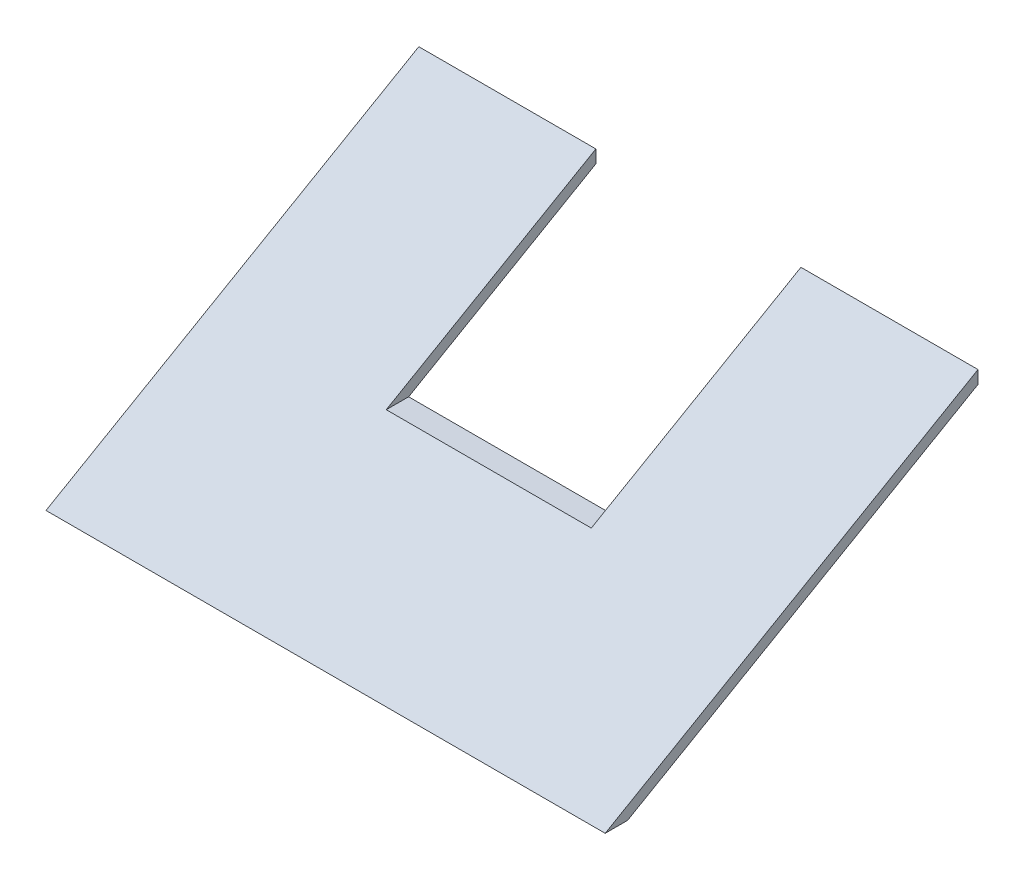
ISO-10303-21;
HEADER;
FILE_DESCRIPTION(('STEP AP214'),'2;1');
FILE_NAME('part.step','',(''),(''),'','','');
FILE_SCHEMA(('AUTOMOTIVE_DESIGN { 1 0 10303 214 1 1 1 1 }'));
ENDSEC;
DATA;
#1=APPLICATION_CONTEXT('core data for automotive mechanical design processes');
#2=APPLICATION_PROTOCOL_DEFINITION('international standard','automotive_design',2000,#1);
#3=PRODUCT_CONTEXT('',#1,'mechanical');
#4=PRODUCT('Part','Part','',(#3));
#5=PRODUCT_RELATED_PRODUCT_CATEGORY('part','',(#4));
#6=PRODUCT_DEFINITION_FORMATION('','',#4);
#7=PRODUCT_DEFINITION_CONTEXT('part definition',#1,'design');
#8=PRODUCT_DEFINITION('design','',#6,#7);
#9=PRODUCT_DEFINITION_SHAPE('','',#8);
#10=(LENGTH_UNIT() NAMED_UNIT(*) SI_UNIT(.MILLI.,.METRE.));
#11=(NAMED_UNIT(*) PLANE_ANGLE_UNIT() SI_UNIT($,.RADIAN.));
#12=(NAMED_UNIT(*) SI_UNIT($,.STERADIAN.) SOLID_ANGLE_UNIT());
#13=UNCERTAINTY_MEASURE_WITH_UNIT(LENGTH_MEASURE(1.E-05),#10,'distance_accuracy_value','');
#14=(GEOMETRIC_REPRESENTATION_CONTEXT(3) GLOBAL_UNCERTAINTY_ASSIGNED_CONTEXT((#13)) GLOBAL_UNIT_ASSIGNED_CONTEXT((#10,
#11,#12)) REPRESENTATION_CONTEXT('',''));
#15=CARTESIAN_POINT('',(0.,0.,0.));
#16=DIRECTION('',(0.,0.,1.));
#17=DIRECTION('',(1.,0.,0.));
#18=AXIS2_PLACEMENT_3D('',#15,#16,#17);
#19=CARTESIAN_POINT('',(150.,3.46410161513772,0.));
#20=DIRECTION('',(0.,0.,1.));
#21=DIRECTION('',(0.,-1.,0.));
#22=AXIS2_PLACEMENT_3D('',#19,#20,#21);
#23=PLANE('',#22);
#24=DIRECTION('',(0.,-1.,0.));
#25=VECTOR('',#24,1.);
#26=CARTESIAN_POINT('',(47.5,0.,0.));
#27=LINE('',#26,#25);
#28=CARTESIAN_POINT('',(47.5,3.46410161513772,0.));
#29=VERTEX_POINT('',#28);
#30=CARTESIAN_POINT('',(47.5,0.,0.));
#31=VERTEX_POINT('',#30);
#32=EDGE_CURVE('E122',#29,#31,#27,.T.);
#33=ORIENTED_EDGE('',*,*,#32,.T.);
#34=DIRECTION('',(-1.,0.,0.));
#35=VECTOR('',#34,1.);
#36=CARTESIAN_POINT('',(150.,0.,0.));
#37=LINE('',#36,#35);
#38=CARTESIAN_POINT('',(0.,0.,0.));
#39=VERTEX_POINT('',#38);
#40=EDGE_CURVE('E79',#31,#39,#37,.T.);
#41=ORIENTED_EDGE('',*,*,#40,.T.);
#42=DIRECTION('',(0.,1.,0.));
#43=VECTOR('',#42,1.);
#44=CARTESIAN_POINT('',(0.,3.46410161513772,0.));
#45=LINE('',#44,#43);
#46=CARTESIAN_POINT('',(0.,3.46410161513772,0.));
#47=VERTEX_POINT('',#46);
#48=EDGE_CURVE('E167',#39,#47,#45,.T.);
#49=ORIENTED_EDGE('',*,*,#48,.T.);
#50=DIRECTION('',(-1.,0.,0.));
#51=VECTOR('',#50,1.);
#52=CARTESIAN_POINT('',(150.,3.46410161513772,0.));
#53=LINE('',#52,#51);
#54=EDGE_CURVE('E127',#29,#47,#53,.T.);
#55=ORIENTED_EDGE('',*,*,#54,.F.);
#56=EDGE_LOOP('',(#33,#41,#49,#55));
#57=FACE_BOUND('',#56,.T.);
#58=ADVANCED_FACE('F34',(#57),#23,.F.);
#59=DIRECTION('',(0.,1.,0.));
#60=VECTOR('',#59,1.);
#61=CARTESIAN_POINT('',(102.5,0.,0.));
#62=LINE('',#61,#60);
#63=CARTESIAN_POINT('',(102.5,0.,0.));
#64=VERTEX_POINT('',#63);
#65=CARTESIAN_POINT('',(102.5,3.46410161513772,0.));
#66=VERTEX_POINT('',#65);
#67=EDGE_CURVE('E48',#64,#66,#62,.T.);
#68=ORIENTED_EDGE('',*,*,#67,.T.);
#69=CARTESIAN_POINT('',(150.,3.46410161513772,0.));
#70=VERTEX_POINT('',#69);
#71=EDGE_CURVE('E120',#70,#66,#53,.T.);
#72=ORIENTED_EDGE('',*,*,#71,.F.);
#73=DIRECTION('',(0.,1.,0.));
#74=VECTOR('',#73,1.);
#75=CARTESIAN_POINT('',(150.,3.46410161513772,0.));
#76=LINE('',#75,#74);
#77=CARTESIAN_POINT('',(150.,0.,0.));
#78=VERTEX_POINT('',#77);
#79=EDGE_CURVE('E166',#78,#70,#76,.T.);
#80=ORIENTED_EDGE('',*,*,#79,.F.);
#81=EDGE_CURVE('E121',#78,#64,#37,.T.);
#82=ORIENTED_EDGE('',*,*,#81,.T.);
#83=EDGE_LOOP('',(#68,#72,#80,#82));
#84=FACE_BOUND('',#83,.T.);
#85=ADVANCED_FACE('F118',(#84),#23,.F.);
#86=CARTESIAN_POINT('',(150.,-54.2709253038241,100.));
#87=DIRECTION('',(0.,-0.866025403784442,-0.499999999999995));
#88=DIRECTION('',(0.,0.499999999999995,-0.866025403784442));
#89=AXIS2_PLACEMENT_3D('',#86,#87,#88);
#90=PLANE('',#89);
#91=DIRECTION('',(0.,-0.499999999999995,0.866025403784442));
#92=VECTOR('',#91,1.);
#93=CARTESIAN_POINT('',(47.5,-54.2709253038241,100.));
#94=LINE('',#93,#92);
#95=CARTESIAN_POINT('',(47.5,-29.,56.2294734194982));
#96=VERTEX_POINT('',#95);
#97=EDGE_CURVE('E142',#29,#96,#94,.T.);
#98=ORIENTED_EDGE('',*,*,#97,.F.);
#99=ORIENTED_EDGE('',*,*,#54,.T.);
#100=DIRECTION('',(0.,-0.499999999999995,0.866025403784441));
#101=VECTOR('',#100,1.);
#102=CARTESIAN_POINT('',(0.,-54.2709253038241,100.));
#103=LINE('',#102,#101);
#104=CARTESIAN_POINT('',(0.,-54.2709253038241,100.));
#105=VERTEX_POINT('',#104);
#106=EDGE_CURVE('E165',#47,#105,#103,.T.);
#107=ORIENTED_EDGE('',*,*,#106,.T.);
#108=DIRECTION('',(-1.,0.,0.));
#109=VECTOR('',#108,1.);
#110=CARTESIAN_POINT('',(150.,-54.2709253038241,100.));
#111=LINE('',#110,#109);
#112=CARTESIAN_POINT('',(150.,-54.2709253038241,100.));
#113=VERTEX_POINT('',#112);
#114=EDGE_CURVE('E130',#113,#105,#111,.T.);
#115=ORIENTED_EDGE('',*,*,#114,.F.);
#116=DIRECTION('',(0.,-0.499999999999995,0.866025403784441));
#117=VECTOR('',#116,1.);
#118=CARTESIAN_POINT('',(150.,-54.2709253038241,100.));
#119=LINE('',#118,#117);
#120=EDGE_CURVE('E87',#70,#113,#119,.T.);
#121=ORIENTED_EDGE('',*,*,#120,.F.);
#122=ORIENTED_EDGE('',*,*,#71,.T.);
#123=DIRECTION('',(0.,0.499999999999995,-0.866025403784442));
#124=VECTOR('',#123,1.);
#125=CARTESIAN_POINT('',(102.5,-54.2709253038241,100.));
#126=LINE('',#125,#124);
#127=CARTESIAN_POINT('',(102.5,-29.,56.2294734194981));
#128=VERTEX_POINT('',#127);
#129=EDGE_CURVE('E107',#128,#66,#126,.T.);
#130=ORIENTED_EDGE('',*,*,#129,.F.);
#131=DIRECTION('',(1.,0.,0.));
#132=VECTOR('',#131,1.);
#133=CARTESIAN_POINT('',(150.,-29.,56.2294734194981));
#134=LINE('',#133,#132);
#135=EDGE_CURVE('E112',#96,#128,#134,.T.);
#136=ORIENTED_EDGE('',*,*,#135,.F.);
#137=EDGE_LOOP('',(#98,#99,#107,#115,#121,#122,#130,#136));
#138=FACE_BOUND('',#137,.T.);
#139=ADVANCED_FACE('F125',(#138),#90,.F.);
#140=CARTESIAN_POINT('',(150.,0.,0.));
#141=DIRECTION('',(0.,0.866025403784441,0.499999999999995));
#142=DIRECTION('',(0.,-0.499999999999995,0.866025403784441));
#143=AXIS2_PLACEMENT_3D('',#140,#141,#142);
#144=PLANE('',#143);
#145=DIRECTION('',(0.,0.499999999999995,-0.866025403784441));
#146=VECTOR('',#145,1.);
#147=CARTESIAN_POINT('',(47.5,0.,0.));
#148=LINE('',#147,#146);
#149=CARTESIAN_POINT('',(47.5,-29.,50.2294734194981));
#150=VERTEX_POINT('',#149);
#151=EDGE_CURVE('E11',#150,#31,#148,.T.);
#152=ORIENTED_EDGE('',*,*,#151,.F.);
#153=DIRECTION('',(-1.,0.,0.));
#154=VECTOR('',#153,1.);
#155=CARTESIAN_POINT('',(150.,-29.,50.2294734194981));
#156=LINE('',#155,#154);
#157=CARTESIAN_POINT('',(102.5,-29.,50.2294734194981));
#158=VERTEX_POINT('',#157);
#159=EDGE_CURVE('E41',#158,#150,#156,.T.);
#160=ORIENTED_EDGE('',*,*,#159,.F.);
#161=DIRECTION('',(0.,-0.499999999999995,0.866025403784441));
#162=VECTOR('',#161,1.);
#163=CARTESIAN_POINT('',(102.5,0.,0.));
#164=LINE('',#163,#162);
#165=EDGE_CURVE('E126',#64,#158,#164,.T.);
#166=ORIENTED_EDGE('',*,*,#165,.F.);
#167=ORIENTED_EDGE('',*,*,#81,.F.);
#168=DIRECTION('',(0.,0.499999999999995,-0.866025403784441));
#169=VECTOR('',#168,1.);
#170=CARTESIAN_POINT('',(150.,0.,0.));
#171=LINE('',#170,#169);
#172=CARTESIAN_POINT('',(150.,-54.2709253038241,93.9999999999999));
#173=VERTEX_POINT('',#172);
#174=EDGE_CURVE('E57',#173,#78,#171,.T.);
#175=ORIENTED_EDGE('',*,*,#174,.F.);
#176=DIRECTION('',(-1.,0.,0.));
#177=VECTOR('',#176,1.);
#178=CARTESIAN_POINT('',(150.,-54.2709253038241,93.9999999999999));
#179=LINE('',#178,#177);
#180=CARTESIAN_POINT('',(0.,-54.2709253038241,93.9999999999999));
#181=VERTEX_POINT('',#180);
#182=EDGE_CURVE('E150',#173,#181,#179,.T.);
#183=ORIENTED_EDGE('',*,*,#182,.T.);
#184=DIRECTION('',(0.,0.499999999999995,-0.866025403784441));
#185=VECTOR('',#184,1.);
#186=CARTESIAN_POINT('',(0.,0.,0.));
#187=LINE('',#186,#185);
#188=EDGE_CURVE('E147',#181,#39,#187,.T.);
#189=ORIENTED_EDGE('',*,*,#188,.T.);
#190=ORIENTED_EDGE('',*,*,#40,.F.);
#191=EDGE_LOOP('',(#152,#160,#166,#167,#175,#183,#189,#190));
#192=FACE_BOUND('',#191,.T.);
#193=ADVANCED_FACE('F144',(#192),#144,.F.);
#194=CARTESIAN_POINT('',(150.,-54.2709253038241,93.9999999999999));
#195=DIRECTION('',(0.,1.,0.));
#196=DIRECTION('',(0.,0.,1.));
#197=AXIS2_PLACEMENT_3D('',#194,#195,#196);
#198=PLANE('',#197);
#199=DIRECTION('',(0.,0.,-1.));
#200=VECTOR('',#199,1.);
#201=CARTESIAN_POINT('',(0.,-54.2709253038241,93.9999999999999));
#202=LINE('',#201,#200);
#203=EDGE_CURVE('E161',#105,#181,#202,.T.);
#204=ORIENTED_EDGE('',*,*,#203,.T.);
#205=ORIENTED_EDGE('',*,*,#182,.F.);
#206=DIRECTION('',(0.,0.,-1.));
#207=VECTOR('',#206,1.);
#208=CARTESIAN_POINT('',(150.,-54.2709253038241,93.9999999999999));
#209=LINE('',#208,#207);
#210=EDGE_CURVE('E151',#113,#173,#209,.T.);
#211=ORIENTED_EDGE('',*,*,#210,.F.);
#212=ORIENTED_EDGE('',*,*,#114,.T.);
#213=EDGE_LOOP('',(#204,#205,#211,#212));
#214=FACE_BOUND('',#213,.T.);
#215=ADVANCED_FACE('F160',(#214),#198,.F.);
#216=CARTESIAN_POINT('',(150.,0.,0.));
#217=DIRECTION('',(-1.,0.,0.));
#218=DIRECTION('',(0.,0.,1.));
#219=AXIS2_PLACEMENT_3D('',#216,#217,#218);
#220=PLANE('',#219);
#221=ORIENTED_EDGE('',*,*,#79,.T.);
#222=ORIENTED_EDGE('',*,*,#120,.T.);
#223=ORIENTED_EDGE('',*,*,#210,.T.);
#224=ORIENTED_EDGE('',*,*,#174,.T.);
#225=EDGE_LOOP('',(#221,#222,#223,#224));
#226=FACE_BOUND('',#225,.T.);
#227=ADVANCED_FACE('F192',(#226),#220,.F.);
#228=CARTESIAN_POINT('',(0.,0.,0.));
#229=DIRECTION('',(-1.,0.,0.));
#230=DIRECTION('',(0.,0.,1.));
#231=AXIS2_PLACEMENT_3D('',#228,#229,#230);
#232=PLANE('',#231);
#233=ORIENTED_EDGE('',*,*,#48,.F.);
#234=ORIENTED_EDGE('',*,*,#188,.F.);
#235=ORIENTED_EDGE('',*,*,#203,.F.);
#236=ORIENTED_EDGE('',*,*,#106,.F.);
#237=EDGE_LOOP('',(#233,#234,#235,#236));
#238=FACE_BOUND('',#237,.T.);
#239=ADVANCED_FACE('F164',(#238),#232,.T.);
#240=CARTESIAN_POINT('',(47.5,0.,100.));
#241=DIRECTION('',(1.,0.,0.));
#242=DIRECTION('',(0.,0.,-1.));
#243=AXIS2_PLACEMENT_3D('',#240,#241,#242);
#244=PLANE('',#243);
#245=ORIENTED_EDGE('',*,*,#97,.T.);
#246=DIRECTION('',(0.,0.,-1.));
#247=VECTOR('',#246,1.);
#248=CARTESIAN_POINT('',(47.5,-29.,100.));
#249=LINE('',#248,#247);
#250=EDGE_CURVE('E113',#96,#150,#249,.T.);
#251=ORIENTED_EDGE('',*,*,#250,.T.);
#252=ORIENTED_EDGE('',*,*,#151,.T.);
#253=ORIENTED_EDGE('',*,*,#32,.F.);
#254=EDGE_LOOP('',(#245,#251,#252,#253));
#255=FACE_BOUND('',#254,.T.);
#256=ADVANCED_FACE('F141',(#255),#244,.T.);
#257=CARTESIAN_POINT('',(102.5,-29.,100.));
#258=DIRECTION('',(0.,1.,0.));
#259=DIRECTION('',(-1.,0.,0.));
#260=AXIS2_PLACEMENT_3D('',#257,#258,#259);
#261=PLANE('',#260);
#262=ORIENTED_EDGE('',*,*,#135,.T.);
#263=DIRECTION('',(0.,0.,-1.));
#264=VECTOR('',#263,1.);
#265=CARTESIAN_POINT('',(102.5,-29.,100.));
#266=LINE('',#265,#264);
#267=EDGE_CURVE('E110',#128,#158,#266,.T.);
#268=ORIENTED_EDGE('',*,*,#267,.T.);
#269=ORIENTED_EDGE('',*,*,#159,.T.);
#270=ORIENTED_EDGE('',*,*,#250,.F.);
#271=EDGE_LOOP('',(#262,#268,#269,#270));
#272=FACE_BOUND('',#271,.T.);
#273=ADVANCED_FACE('F137',(#272),#261,.T.);
#274=CARTESIAN_POINT('',(102.5,0.,100.));
#275=DIRECTION('',(-1.,0.,0.));
#276=DIRECTION('',(0.,-1.,0.));
#277=AXIS2_PLACEMENT_3D('',#274,#275,#276);
#278=PLANE('',#277);
#279=ORIENTED_EDGE('',*,*,#129,.T.);
#280=ORIENTED_EDGE('',*,*,#67,.F.);
#281=ORIENTED_EDGE('',*,*,#165,.T.);
#282=ORIENTED_EDGE('',*,*,#267,.F.);
#283=EDGE_LOOP('',(#279,#280,#281,#282));
#284=FACE_BOUND('',#283,.T.);
#285=ADVANCED_FACE('F108',(#284),#278,.T.);
#286=CLOSED_SHELL('',(#58,#85,#139,#193,#215,#227,#239,#256,#273,#285));
#287=MANIFOLD_SOLID_BREP('B2',#286);
#288=ADVANCED_BREP_SHAPE_REPRESENTATION('',(#18,#287),#14);
#289=SHAPE_DEFINITION_REPRESENTATION(#9,#288);
ENDSEC;
END-ISO-10303-21;
